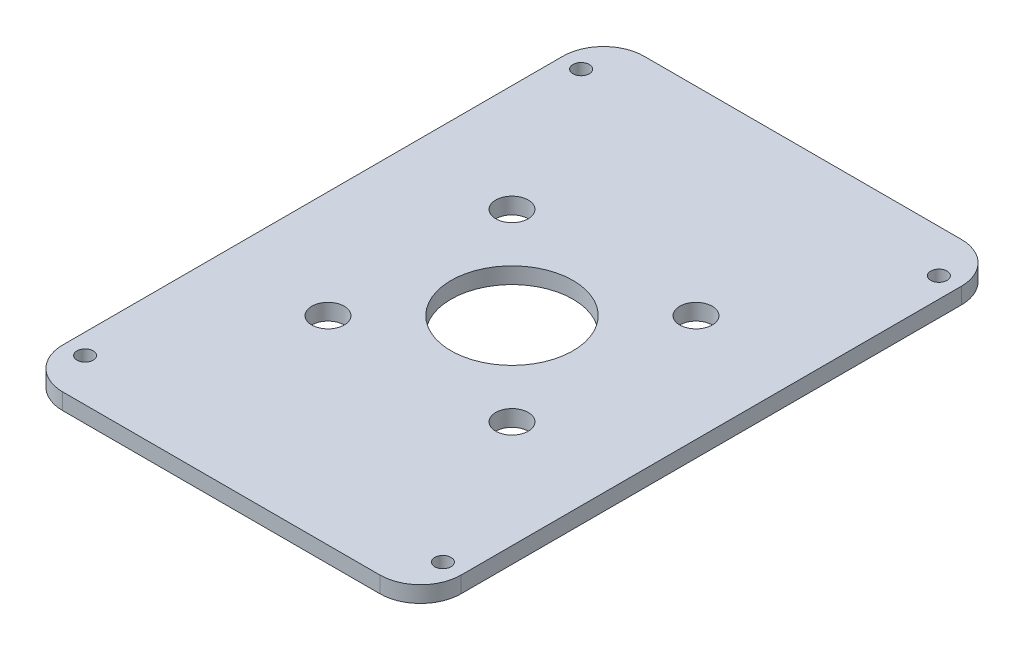
ISO-10303-21;
HEADER;
FILE_DESCRIPTION(('STEP AP214'),'2;1');
FILE_NAME('part.step','',(''),(''),'','','');
FILE_SCHEMA(('AUTOMOTIVE_DESIGN { 1 0 10303 214 1 1 1 1 }'));
ENDSEC;
DATA;
#1=APPLICATION_CONTEXT('core data for automotive mechanical design processes');
#2=APPLICATION_PROTOCOL_DEFINITION('international standard','automotive_design',2000,#1);
#3=PRODUCT_CONTEXT('',#1,'mechanical');
#4=PRODUCT('Part','Part','',(#3));
#5=PRODUCT_RELATED_PRODUCT_CATEGORY('part','',(#4));
#6=PRODUCT_DEFINITION_FORMATION('','',#4);
#7=PRODUCT_DEFINITION_CONTEXT('part definition',#1,'design');
#8=PRODUCT_DEFINITION('design','',#6,#7);
#9=PRODUCT_DEFINITION_SHAPE('','',#8);
#10=(LENGTH_UNIT() NAMED_UNIT(*) SI_UNIT(.MILLI.,.METRE.));
#11=(NAMED_UNIT(*) PLANE_ANGLE_UNIT() SI_UNIT($,.RADIAN.));
#12=(NAMED_UNIT(*) SI_UNIT($,.STERADIAN.) SOLID_ANGLE_UNIT());
#13=UNCERTAINTY_MEASURE_WITH_UNIT(LENGTH_MEASURE(1.E-05),#10,'distance_accuracy_value','');
#14=(GEOMETRIC_REPRESENTATION_CONTEXT(3) GLOBAL_UNCERTAINTY_ASSIGNED_CONTEXT((#13)) GLOBAL_UNIT_ASSIGNED_CONTEXT((#10,
#11,#12)) REPRESENTATION_CONTEXT('',''));
#15=CARTESIAN_POINT('',(0.,0.,0.));
#16=DIRECTION('',(0.,0.,1.));
#17=DIRECTION('',(1.,0.,0.));
#18=AXIS2_PLACEMENT_3D('',#15,#16,#17);
#19=CARTESIAN_POINT('',(-24.5,2.,-35.75));
#20=DIRECTION('',(0.,0.,-1.));
#21=DIRECTION('',(-1.,0.,0.));
#22=AXIS2_PLACEMENT_3D('',#19,#20,#21);
#23=PLANE('',#22);
#24=DIRECTION('',(1.,0.,0.));
#25=VECTOR('',#24,1.);
#26=CARTESIAN_POINT('',(-24.5,2.,-35.75));
#27=LINE('',#26,#25);
#28=CARTESIAN_POINT('',(-19.5,2.,-35.75));
#29=VERTEX_POINT('',#28);
#30=CARTESIAN_POINT('',(19.5,2.,-35.75));
#31=VERTEX_POINT('',#30);
#32=EDGE_CURVE('E168',#29,#31,#27,.T.);
#33=ORIENTED_EDGE('',*,*,#32,.T.);
#34=DIRECTION('',(0.,-1.,0.));
#35=VECTOR('',#34,1.);
#36=CARTESIAN_POINT('',(19.5,2.,-35.75));
#37=LINE('',#36,#35);
#38=CARTESIAN_POINT('',(19.5,0.,-35.75));
#39=VERTEX_POINT('',#38);
#40=EDGE_CURVE('E122',#31,#39,#37,.T.);
#41=ORIENTED_EDGE('',*,*,#40,.T.);
#42=DIRECTION('',(1.,0.,0.));
#43=VECTOR('',#42,1.);
#44=CARTESIAN_POINT('',(-24.5,0.,-35.75));
#45=LINE('',#44,#43);
#46=CARTESIAN_POINT('',(-19.5,0.,-35.75));
#47=VERTEX_POINT('',#46);
#48=EDGE_CURVE('E106',#47,#39,#45,.T.);
#49=ORIENTED_EDGE('',*,*,#48,.F.);
#50=DIRECTION('',(0.,-1.,0.));
#51=VECTOR('',#50,1.);
#52=CARTESIAN_POINT('',(-19.5,2.,-35.75));
#53=LINE('',#52,#51);
#54=EDGE_CURVE('E119',#47,#29,#53,.F.);
#55=ORIENTED_EDGE('',*,*,#54,.T.);
#56=EDGE_LOOP('',(#33,#41,#49,#55));
#57=FACE_BOUND('',#56,.T.);
#58=ADVANCED_FACE('F37',(#57),#23,.T.);
#59=CARTESIAN_POINT('',(-24.5,2.,-35.75));
#60=DIRECTION('',(1.,0.,0.));
#61=DIRECTION('',(0.,0.,-1.));
#62=AXIS2_PLACEMENT_3D('',#59,#60,#61);
#63=PLANE('',#62);
#64=DIRECTION('',(0.,0.,1.));
#65=VECTOR('',#64,1.);
#66=CARTESIAN_POINT('',(-24.5,2.,-35.75));
#67=LINE('',#66,#65);
#68=CARTESIAN_POINT('',(-24.5,2.,-30.75));
#69=VERTEX_POINT('',#68);
#70=CARTESIAN_POINT('',(-24.5,2.,30.75));
#71=VERTEX_POINT('',#70);
#72=EDGE_CURVE('E129',#69,#71,#67,.T.);
#73=ORIENTED_EDGE('',*,*,#72,.F.);
#74=DIRECTION('',(0.,-1.,0.));
#75=VECTOR('',#74,1.);
#76=CARTESIAN_POINT('',(-24.5,0.,-30.75));
#77=LINE('',#76,#75);
#78=CARTESIAN_POINT('',(-24.5,0.,-30.75));
#79=VERTEX_POINT('',#78);
#80=EDGE_CURVE('E154',#69,#79,#77,.T.);
#81=ORIENTED_EDGE('',*,*,#80,.T.);
#82=DIRECTION('',(0.,0.,1.));
#83=VECTOR('',#82,1.);
#84=CARTESIAN_POINT('',(-24.5,0.,-35.75));
#85=LINE('',#84,#83);
#86=CARTESIAN_POINT('',(-24.5,0.,30.75));
#87=VERTEX_POINT('',#86);
#88=EDGE_CURVE('E108',#79,#87,#85,.T.);
#89=ORIENTED_EDGE('',*,*,#88,.T.);
#90=DIRECTION('',(0.,-1.,0.));
#91=VECTOR('',#90,1.);
#92=CARTESIAN_POINT('',(-24.5,2.,30.75));
#93=LINE('',#92,#91);
#94=EDGE_CURVE('E152',#87,#71,#93,.F.);
#95=ORIENTED_EDGE('',*,*,#94,.T.);
#96=EDGE_LOOP('',(#73,#81,#89,#95));
#97=FACE_BOUND('',#96,.T.);
#98=ADVANCED_FACE('F157',(#97),#63,.F.);
#99=CARTESIAN_POINT('',(-24.5,2.,35.75));
#100=DIRECTION('',(0.,0.,-1.));
#101=DIRECTION('',(-1.,0.,0.));
#102=AXIS2_PLACEMENT_3D('',#99,#100,#101);
#103=PLANE('',#102);
#104=DIRECTION('',(1.,0.,0.));
#105=VECTOR('',#104,1.);
#106=CARTESIAN_POINT('',(-24.5,2.,35.75));
#107=LINE('',#106,#105);
#108=CARTESIAN_POINT('',(-19.5,2.,35.75));
#109=VERTEX_POINT('',#108);
#110=CARTESIAN_POINT('',(19.5,2.,35.75));
#111=VERTEX_POINT('',#110);
#112=EDGE_CURVE('E133',#109,#111,#107,.T.);
#113=ORIENTED_EDGE('',*,*,#112,.F.);
#114=DIRECTION('',(0.,-1.,0.));
#115=VECTOR('',#114,1.);
#116=CARTESIAN_POINT('',(-19.5,2.,35.75));
#117=LINE('',#116,#115);
#118=CARTESIAN_POINT('',(-19.5,0.,35.75));
#119=VERTEX_POINT('',#118);
#120=EDGE_CURVE('E11',#109,#119,#117,.T.);
#121=ORIENTED_EDGE('',*,*,#120,.T.);
#122=DIRECTION('',(1.,0.,0.));
#123=VECTOR('',#122,1.);
#124=CARTESIAN_POINT('',(-24.5,0.,35.75));
#125=LINE('',#124,#123);
#126=CARTESIAN_POINT('',(19.5,0.,35.75));
#127=VERTEX_POINT('',#126);
#128=EDGE_CURVE('E166',#119,#127,#125,.T.);
#129=ORIENTED_EDGE('',*,*,#128,.T.);
#130=DIRECTION('',(0.,-1.,0.));
#131=VECTOR('',#130,1.);
#132=CARTESIAN_POINT('',(19.5,2.,35.75));
#133=LINE('',#132,#131);
#134=EDGE_CURVE('E45',#127,#111,#133,.F.);
#135=ORIENTED_EDGE('',*,*,#134,.T.);
#136=EDGE_LOOP('',(#113,#121,#129,#135));
#137=FACE_BOUND('',#136,.T.);
#138=ADVANCED_FACE('F165',(#137),#103,.F.);
#139=CARTESIAN_POINT('',(24.5,2.,-35.75));
#140=DIRECTION('',(1.,0.,0.));
#141=DIRECTION('',(0.,0.,-1.));
#142=AXIS2_PLACEMENT_3D('',#139,#140,#141);
#143=PLANE('',#142);
#144=DIRECTION('',(0.,0.,1.));
#145=VECTOR('',#144,1.);
#146=CARTESIAN_POINT('',(24.5,0.,-35.75));
#147=LINE('',#146,#145);
#148=CARTESIAN_POINT('',(24.5,0.,-30.75));
#149=VERTEX_POINT('',#148);
#150=CARTESIAN_POINT('',(24.5,0.,30.75));
#151=VERTEX_POINT('',#150);
#152=EDGE_CURVE('E123',#149,#151,#147,.T.);
#153=ORIENTED_EDGE('',*,*,#152,.F.);
#154=DIRECTION('',(0.,-1.,0.));
#155=VECTOR('',#154,1.);
#156=CARTESIAN_POINT('',(24.5,2.,-30.75));
#157=LINE('',#156,#155);
#158=CARTESIAN_POINT('',(24.5,2.,-30.75));
#159=VERTEX_POINT('',#158);
#160=EDGE_CURVE('E144',#149,#159,#157,.F.);
#161=ORIENTED_EDGE('',*,*,#160,.T.);
#162=DIRECTION('',(0.,0.,1.));
#163=VECTOR('',#162,1.);
#164=CARTESIAN_POINT('',(24.5,2.,-35.75));
#165=LINE('',#164,#163);
#166=CARTESIAN_POINT('',(24.5,2.,30.75));
#167=VERTEX_POINT('',#166);
#168=EDGE_CURVE('E172',#159,#167,#165,.T.);
#169=ORIENTED_EDGE('',*,*,#168,.T.);
#170=DIRECTION('',(0.,-1.,0.));
#171=VECTOR('',#170,1.);
#172=CARTESIAN_POINT('',(24.5,0.,30.75));
#173=LINE('',#172,#171);
#174=EDGE_CURVE('E141',#167,#151,#173,.T.);
#175=ORIENTED_EDGE('',*,*,#174,.T.);
#176=EDGE_LOOP('',(#153,#161,#169,#175));
#177=FACE_BOUND('',#176,.T.);
#178=ADVANCED_FACE('F242',(#177),#143,.T.);
#179=CARTESIAN_POINT('',(0.,2.,0.));
#180=DIRECTION('',(0.,-1.,0.));
#181=DIRECTION('',(0.,0.,-1.));
#182=AXIS2_PLACEMENT_3D('',#179,#180,#181);
#183=PLANE('',#182);
#184=CARTESIAN_POINT('',(0.,2.,0.));
#185=DIRECTION('',(0.,-1.,0.));
#186=DIRECTION('',(0.,0.,-1.));
#187=AXIS2_PLACEMENT_3D('',#184,#185,#186);
#188=CIRCLE('',#187,7.5);
#189=CARTESIAN_POINT('',(0.,2.,-7.49999999999999));
#190=VERTEX_POINT('',#189);
#191=EDGE_CURVE('E124',#190,#190,#188,.F.);
#192=ORIENTED_EDGE('',*,*,#191,.F.);
#193=EDGE_LOOP('',(#192));
#194=FACE_BOUND('',#193,.T.);
#195=CARTESIAN_POINT('',(-22.,2.,30.5));
#196=DIRECTION('',(0.,-1.,0.));
#197=DIRECTION('',(0.,0.,-1.));
#198=AXIS2_PLACEMENT_3D('',#195,#196,#197);
#199=CIRCLE('',#198,1.);
#200=CARTESIAN_POINT('',(-22.,2.,29.5));
#201=VERTEX_POINT('',#200);
#202=EDGE_CURVE('E178',#201,#201,#199,.F.);
#203=ORIENTED_EDGE('',*,*,#202,.F.);
#204=EDGE_LOOP('',(#203));
#205=FACE_BOUND('',#204,.T.);
#206=CARTESIAN_POINT('',(22.,2.,30.5));
#207=DIRECTION('',(0.,-1.,0.));
#208=DIRECTION('',(0.,0.,-1.));
#209=AXIS2_PLACEMENT_3D('',#206,#207,#208);
#210=CIRCLE('',#209,1.);
#211=CARTESIAN_POINT('',(22.,2.,29.5));
#212=VERTEX_POINT('',#211);
#213=EDGE_CURVE('E181',#212,#212,#210,.F.);
#214=ORIENTED_EDGE('',*,*,#213,.F.);
#215=EDGE_LOOP('',(#214));
#216=FACE_BOUND('',#215,.T.);
#217=CARTESIAN_POINT('',(22.,2.,-30.5));
#218=DIRECTION('',(0.,-1.,0.));
#219=DIRECTION('',(0.,0.,-1.));
#220=AXIS2_PLACEMENT_3D('',#217,#218,#219);
#221=CIRCLE('',#220,1.);
#222=CARTESIAN_POINT('',(22.,2.,-31.5));
#223=VERTEX_POINT('',#222);
#224=EDGE_CURVE('E184',#223,#223,#221,.F.);
#225=ORIENTED_EDGE('',*,*,#224,.F.);
#226=EDGE_LOOP('',(#225));
#227=FACE_BOUND('',#226,.T.);
#228=CARTESIAN_POINT('',(11.3137084989848,2.,-11.3137084989847));
#229=DIRECTION('',(0.,-1.,0.));
#230=DIRECTION('',(0.,0.,-1.));
#231=AXIS2_PLACEMENT_3D('',#228,#229,#230);
#232=CIRCLE('',#231,2.);
#233=CARTESIAN_POINT('',(11.3137084989848,2.,-13.3137084989847));
#234=VERTEX_POINT('',#233);
#235=EDGE_CURVE('E187',#234,#234,#232,.F.);
#236=ORIENTED_EDGE('',*,*,#235,.F.);
#237=EDGE_LOOP('',(#236));
#238=FACE_BOUND('',#237,.T.);
#239=CARTESIAN_POINT('',(11.3137084989853,2.,11.3137084989848));
#240=DIRECTION('',(0.,-1.,0.));
#241=DIRECTION('',(0.,0.,-1.));
#242=AXIS2_PLACEMENT_3D('',#239,#240,#241);
#243=CIRCLE('',#242,2.);
#244=CARTESIAN_POINT('',(11.3137084989853,2.,9.31370849898481));
#245=VERTEX_POINT('',#244);
#246=EDGE_CURVE('E190',#245,#245,#243,.F.);
#247=ORIENTED_EDGE('',*,*,#246,.F.);
#248=EDGE_LOOP('',(#247));
#249=FACE_BOUND('',#248,.T.);
#250=CARTESIAN_POINT('',(-11.3137084989842,2.,11.3137084989853));
#251=DIRECTION('',(0.,-1.,0.));
#252=DIRECTION('',(0.,0.,-1.));
#253=AXIS2_PLACEMENT_3D('',#250,#251,#252);
#254=CIRCLE('',#253,2.);
#255=CARTESIAN_POINT('',(-11.3137084989842,2.,9.3137084989853));
#256=VERTEX_POINT('',#255);
#257=EDGE_CURVE('E193',#256,#256,#254,.F.);
#258=ORIENTED_EDGE('',*,*,#257,.F.);
#259=EDGE_LOOP('',(#258));
#260=FACE_BOUND('',#259,.T.);
#261=CARTESIAN_POINT('',(-11.3137084989847,2.,-11.3137084989842));
#262=DIRECTION('',(0.,-1.,0.));
#263=DIRECTION('',(0.,0.,-1.));
#264=AXIS2_PLACEMENT_3D('',#261,#262,#263);
#265=CIRCLE('',#264,2.);
#266=CARTESIAN_POINT('',(-11.3137084989847,2.,-13.3137084989842));
#267=VERTEX_POINT('',#266);
#268=EDGE_CURVE('E196',#267,#267,#265,.F.);
#269=ORIENTED_EDGE('',*,*,#268,.F.);
#270=EDGE_LOOP('',(#269));
#271=FACE_BOUND('',#270,.T.);
#272=CARTESIAN_POINT('',(-22.,2.,-30.5));
#273=DIRECTION('',(0.,-1.,0.));
#274=DIRECTION('',(0.,0.,-1.));
#275=AXIS2_PLACEMENT_3D('',#272,#273,#274);
#276=CIRCLE('',#275,1.);
#277=CARTESIAN_POINT('',(-22.,2.,-31.5));
#278=VERTEX_POINT('',#277);
#279=EDGE_CURVE('E199',#278,#278,#276,.F.);
#280=ORIENTED_EDGE('',*,*,#279,.F.);
#281=EDGE_LOOP('',(#280));
#282=FACE_BOUND('',#281,.T.);
#283=ORIENTED_EDGE('',*,*,#168,.F.);
#284=CARTESIAN_POINT('',(19.5,2.,-30.75));
#285=DIRECTION('',(0.,-1.,0.));
#286=DIRECTION('',(0.,0.,-1.));
#287=AXIS2_PLACEMENT_3D('',#284,#285,#286);
#288=CIRCLE('',#287,5.);
#289=EDGE_CURVE('E150',#159,#31,#288,.F.);
#290=ORIENTED_EDGE('',*,*,#289,.T.);
#291=ORIENTED_EDGE('',*,*,#32,.F.);
#292=CARTESIAN_POINT('',(-19.5,2.,-30.75));
#293=DIRECTION('',(0.,-1.,0.));
#294=DIRECTION('',(0.,0.,-1.));
#295=AXIS2_PLACEMENT_3D('',#292,#293,#294);
#296=CIRCLE('',#295,5.);
#297=EDGE_CURVE('E128',#29,#69,#296,.F.);
#298=ORIENTED_EDGE('',*,*,#297,.T.);
#299=ORIENTED_EDGE('',*,*,#72,.T.);
#300=CARTESIAN_POINT('',(-19.5,2.,30.75));
#301=DIRECTION('',(0.,-1.,0.));
#302=DIRECTION('',(0.,0.,-1.));
#303=AXIS2_PLACEMENT_3D('',#300,#301,#302);
#304=CIRCLE('',#303,5.);
#305=EDGE_CURVE('E58',#71,#109,#304,.F.);
#306=ORIENTED_EDGE('',*,*,#305,.T.);
#307=ORIENTED_EDGE('',*,*,#112,.T.);
#308=CARTESIAN_POINT('',(19.5,2.,30.75));
#309=DIRECTION('',(0.,-1.,0.));
#310=DIRECTION('',(0.,0.,-1.));
#311=AXIS2_PLACEMENT_3D('',#308,#309,#310);
#312=CIRCLE('',#311,5.);
#313=EDGE_CURVE('E146',#111,#167,#312,.F.);
#314=ORIENTED_EDGE('',*,*,#313,.T.);
#315=EDGE_LOOP('',(#283,#290,#291,#298,#299,#306,#307,#314));
#316=FACE_BOUND('',#315,.T.);
#317=ADVANCED_FACE('F160',(#194,#205,#216,#227,#238,#249,#260,#271,#282,#316),#183,.F.);
#318=CARTESIAN_POINT('',(0.,0.,0.));
#319=DIRECTION('',(0.,-1.,0.));
#320=DIRECTION('',(0.,0.,-1.));
#321=AXIS2_PLACEMENT_3D('',#318,#319,#320);
#322=PLANE('',#321);
#323=CARTESIAN_POINT('',(0.,0.,0.));
#324=DIRECTION('',(0.,1.,0.));
#325=DIRECTION('',(0.,0.,1.));
#326=AXIS2_PLACEMENT_3D('',#323,#324,#325);
#327=CIRCLE('',#326,7.5);
#328=CARTESIAN_POINT('',(0.,0.,7.50000000000001));
#329=VERTEX_POINT('',#328);
#330=EDGE_CURVE('E205',#329,#329,#327,.T.);
#331=ORIENTED_EDGE('',*,*,#330,.T.);
#332=EDGE_LOOP('',(#331));
#333=FACE_BOUND('',#332,.T.);
#334=CARTESIAN_POINT('',(-22.,0.,30.5));
#335=DIRECTION('',(0.,1.,0.));
#336=DIRECTION('',(0.,0.,1.));
#337=AXIS2_PLACEMENT_3D('',#334,#335,#336);
#338=CIRCLE('',#337,1.);
#339=CARTESIAN_POINT('',(-22.,0.,31.5));
#340=VERTEX_POINT('',#339);
#341=EDGE_CURVE('E213',#340,#340,#338,.T.);
#342=ORIENTED_EDGE('',*,*,#341,.T.);
#343=EDGE_LOOP('',(#342));
#344=FACE_BOUND('',#343,.T.);
#345=CARTESIAN_POINT('',(22.,0.,30.5));
#346=DIRECTION('',(0.,1.,0.));
#347=DIRECTION('',(0.,0.,1.));
#348=AXIS2_PLACEMENT_3D('',#345,#346,#347);
#349=CIRCLE('',#348,1.);
#350=CARTESIAN_POINT('',(22.,0.,31.5));
#351=VERTEX_POINT('',#350);
#352=EDGE_CURVE('E209',#351,#351,#349,.T.);
#353=ORIENTED_EDGE('',*,*,#352,.T.);
#354=EDGE_LOOP('',(#353));
#355=FACE_BOUND('',#354,.T.);
#356=CARTESIAN_POINT('',(22.,0.,-30.5));
#357=DIRECTION('',(0.,1.,0.));
#358=DIRECTION('',(0.,0.,1.));
#359=AXIS2_PLACEMENT_3D('',#356,#357,#358);
#360=CIRCLE('',#359,1.);
#361=CARTESIAN_POINT('',(22.,0.,-29.5));
#362=VERTEX_POINT('',#361);
#363=EDGE_CURVE('E206',#362,#362,#360,.T.);
#364=ORIENTED_EDGE('',*,*,#363,.T.);
#365=EDGE_LOOP('',(#364));
#366=FACE_BOUND('',#365,.T.);
#367=CARTESIAN_POINT('',(11.3137084989848,0.,-11.3137084989847));
#368=DIRECTION('',(0.,1.,0.));
#369=DIRECTION('',(0.,0.,1.));
#370=AXIS2_PLACEMENT_3D('',#367,#368,#369);
#371=CIRCLE('',#370,2.);
#372=CARTESIAN_POINT('',(11.3137084989848,0.,-9.3137084989847));
#373=VERTEX_POINT('',#372);
#374=EDGE_CURVE('E210',#373,#373,#371,.T.);
#375=ORIENTED_EDGE('',*,*,#374,.T.);
#376=EDGE_LOOP('',(#375));
#377=FACE_BOUND('',#376,.T.);
#378=CARTESIAN_POINT('',(11.3137084989853,0.,11.3137084989848));
#379=DIRECTION('',(0.,1.,0.));
#380=DIRECTION('',(0.,0.,1.));
#381=AXIS2_PLACEMENT_3D('',#378,#379,#380);
#382=CIRCLE('',#381,2.);
#383=CARTESIAN_POINT('',(11.3137084989853,0.,13.3137084989848));
#384=VERTEX_POINT('',#383);
#385=EDGE_CURVE('E224',#384,#384,#382,.T.);
#386=ORIENTED_EDGE('',*,*,#385,.T.);
#387=EDGE_LOOP('',(#386));
#388=FACE_BOUND('',#387,.T.);
#389=CARTESIAN_POINT('',(-11.3137084989842,0.,11.3137084989853));
#390=DIRECTION('',(0.,1.,0.));
#391=DIRECTION('',(0.,0.,1.));
#392=AXIS2_PLACEMENT_3D('',#389,#390,#391);
#393=CIRCLE('',#392,2.);
#394=CARTESIAN_POINT('',(-11.3137084989842,0.,13.3137084989853));
#395=VERTEX_POINT('',#394);
#396=EDGE_CURVE('E221',#395,#395,#393,.T.);
#397=ORIENTED_EDGE('',*,*,#396,.T.);
#398=EDGE_LOOP('',(#397));
#399=FACE_BOUND('',#398,.T.);
#400=CARTESIAN_POINT('',(-11.3137084989847,0.,-11.3137084989842));
#401=DIRECTION('',(0.,1.,0.));
#402=DIRECTION('',(0.,0.,1.));
#403=AXIS2_PLACEMENT_3D('',#400,#401,#402);
#404=CIRCLE('',#403,2.);
#405=CARTESIAN_POINT('',(-11.3137084989847,0.,-9.31370849898421));
#406=VERTEX_POINT('',#405);
#407=EDGE_CURVE('E218',#406,#406,#404,.T.);
#408=ORIENTED_EDGE('',*,*,#407,.T.);
#409=EDGE_LOOP('',(#408));
#410=FACE_BOUND('',#409,.T.);
#411=CARTESIAN_POINT('',(-22.,0.,-30.5));
#412=DIRECTION('',(0.,1.,0.));
#413=DIRECTION('',(0.,0.,1.));
#414=AXIS2_PLACEMENT_3D('',#411,#412,#413);
#415=CIRCLE('',#414,1.);
#416=CARTESIAN_POINT('',(-22.,0.,-29.5));
#417=VERTEX_POINT('',#416);
#418=EDGE_CURVE('E202',#417,#417,#415,.T.);
#419=ORIENTED_EDGE('',*,*,#418,.T.);
#420=EDGE_LOOP('',(#419));
#421=FACE_BOUND('',#420,.T.);
#422=ORIENTED_EDGE('',*,*,#48,.T.);
#423=CARTESIAN_POINT('',(19.5,0.,-30.75));
#424=DIRECTION('',(0.,-1.,0.));
#425=DIRECTION('',(0.,0.,-1.));
#426=AXIS2_PLACEMENT_3D('',#423,#424,#425);
#427=CIRCLE('',#426,5.);
#428=EDGE_CURVE('E113',#39,#149,#427,.T.);
#429=ORIENTED_EDGE('',*,*,#428,.T.);
#430=ORIENTED_EDGE('',*,*,#152,.T.);
#431=CARTESIAN_POINT('',(19.5,0.,30.75));
#432=DIRECTION('',(0.,-1.,0.));
#433=DIRECTION('',(0.,0.,-1.));
#434=AXIS2_PLACEMENT_3D('',#431,#432,#433);
#435=CIRCLE('',#434,5.);
#436=EDGE_CURVE('E131',#151,#127,#435,.T.);
#437=ORIENTED_EDGE('',*,*,#436,.T.);
#438=ORIENTED_EDGE('',*,*,#128,.F.);
#439=CARTESIAN_POINT('',(-19.5,0.,30.75));
#440=DIRECTION('',(0.,-1.,0.));
#441=DIRECTION('',(0.,0.,-1.));
#442=AXIS2_PLACEMENT_3D('',#439,#440,#441);
#443=CIRCLE('',#442,5.);
#444=EDGE_CURVE('E114',#119,#87,#443,.T.);
#445=ORIENTED_EDGE('',*,*,#444,.T.);
#446=ORIENTED_EDGE('',*,*,#88,.F.);
#447=CARTESIAN_POINT('',(-19.5,0.,-30.75));
#448=DIRECTION('',(0.,-1.,0.));
#449=DIRECTION('',(0.,0.,-1.));
#450=AXIS2_PLACEMENT_3D('',#447,#448,#449);
#451=CIRCLE('',#450,5.);
#452=EDGE_CURVE('E103',#79,#47,#451,.T.);
#453=ORIENTED_EDGE('',*,*,#452,.T.);
#454=EDGE_LOOP('',(#422,#429,#430,#437,#438,#445,#446,#453));
#455=FACE_BOUND('',#454,.T.);
#456=ADVANCED_FACE('F105',(#333,#344,#355,#366,#377,#388,#399,#410,#421,#455),#322,.T.);
#457=CARTESIAN_POINT('',(-22.,10.,-30.5));
#458=DIRECTION('',(0.,-1.,0.));
#459=DIRECTION('',(0.,0.,-1.));
#460=AXIS2_PLACEMENT_3D('',#457,#458,#459);
#461=CYLINDRICAL_SURFACE('',#460,1.);
#462=ORIENTED_EDGE('',*,*,#418,.F.);
#463=EDGE_LOOP('',(#462));
#464=FACE_BOUND('',#463,.T.);
#465=ORIENTED_EDGE('',*,*,#279,.T.);
#466=EDGE_LOOP('',(#465));
#467=FACE_BOUND('',#466,.T.);
#468=ADVANCED_FACE('F253',(#464,#467),#461,.F.);
#469=CARTESIAN_POINT('',(-11.3137084989847,10.,-11.3137084989842));
#470=DIRECTION('',(0.,-1.,0.));
#471=DIRECTION('',(0.,0.,-1.));
#472=AXIS2_PLACEMENT_3D('',#469,#470,#471);
#473=CYLINDRICAL_SURFACE('',#472,2.);
#474=ORIENTED_EDGE('',*,*,#407,.F.);
#475=EDGE_LOOP('',(#474));
#476=FACE_BOUND('',#475,.T.);
#477=ORIENTED_EDGE('',*,*,#268,.T.);
#478=EDGE_LOOP('',(#477));
#479=FACE_BOUND('',#478,.T.);
#480=ADVANCED_FACE('F255',(#476,#479),#473,.F.);
#481=CARTESIAN_POINT('',(-11.3137084989842,10.,11.3137084989853));
#482=DIRECTION('',(0.,-1.,0.));
#483=DIRECTION('',(0.,0.,-1.));
#484=AXIS2_PLACEMENT_3D('',#481,#482,#483);
#485=CYLINDRICAL_SURFACE('',#484,2.);
#486=ORIENTED_EDGE('',*,*,#396,.F.);
#487=EDGE_LOOP('',(#486));
#488=FACE_BOUND('',#487,.T.);
#489=ORIENTED_EDGE('',*,*,#257,.T.);
#490=EDGE_LOOP('',(#489));
#491=FACE_BOUND('',#490,.T.);
#492=ADVANCED_FACE('F262',(#488,#491),#485,.F.);
#493=CARTESIAN_POINT('',(11.3137084989853,10.,11.3137084989848));
#494=DIRECTION('',(0.,-1.,0.));
#495=DIRECTION('',(0.,0.,-1.));
#496=AXIS2_PLACEMENT_3D('',#493,#494,#495);
#497=CYLINDRICAL_SURFACE('',#496,2.);
#498=ORIENTED_EDGE('',*,*,#385,.F.);
#499=EDGE_LOOP('',(#498));
#500=FACE_BOUND('',#499,.T.);
#501=ORIENTED_EDGE('',*,*,#246,.T.);
#502=EDGE_LOOP('',(#501));
#503=FACE_BOUND('',#502,.T.);
#504=ADVANCED_FACE('F236',(#500,#503),#497,.F.);
#505=CARTESIAN_POINT('',(11.3137084989848,10.,-11.3137084989847));
#506=DIRECTION('',(0.,-1.,0.));
#507=DIRECTION('',(0.,0.,-1.));
#508=AXIS2_PLACEMENT_3D('',#505,#506,#507);
#509=CYLINDRICAL_SURFACE('',#508,2.);
#510=ORIENTED_EDGE('',*,*,#374,.F.);
#511=EDGE_LOOP('',(#510));
#512=FACE_BOUND('',#511,.T.);
#513=ORIENTED_EDGE('',*,*,#235,.T.);
#514=EDGE_LOOP('',(#513));
#515=FACE_BOUND('',#514,.T.);
#516=ADVANCED_FACE('F232',(#512,#515),#509,.F.);
#517=CARTESIAN_POINT('',(22.,10.,-30.5));
#518=DIRECTION('',(0.,-1.,0.));
#519=DIRECTION('',(0.,0.,-1.));
#520=AXIS2_PLACEMENT_3D('',#517,#518,#519);
#521=CYLINDRICAL_SURFACE('',#520,1.);
#522=ORIENTED_EDGE('',*,*,#363,.F.);
#523=EDGE_LOOP('',(#522));
#524=FACE_BOUND('',#523,.T.);
#525=ORIENTED_EDGE('',*,*,#224,.T.);
#526=EDGE_LOOP('',(#525));
#527=FACE_BOUND('',#526,.T.);
#528=ADVANCED_FACE('F235',(#524,#527),#521,.F.);
#529=CARTESIAN_POINT('',(22.,10.,30.5));
#530=DIRECTION('',(0.,-1.,0.));
#531=DIRECTION('',(0.,0.,-1.));
#532=AXIS2_PLACEMENT_3D('',#529,#530,#531);
#533=CYLINDRICAL_SURFACE('',#532,1.);
#534=ORIENTED_EDGE('',*,*,#352,.F.);
#535=EDGE_LOOP('',(#534));
#536=FACE_BOUND('',#535,.T.);
#537=ORIENTED_EDGE('',*,*,#213,.T.);
#538=EDGE_LOOP('',(#537));
#539=FACE_BOUND('',#538,.T.);
#540=ADVANCED_FACE('F331',(#536,#539),#533,.F.);
#541=CARTESIAN_POINT('',(-22.,10.,30.5));
#542=DIRECTION('',(0.,-1.,0.));
#543=DIRECTION('',(0.,0.,-1.));
#544=AXIS2_PLACEMENT_3D('',#541,#542,#543);
#545=CYLINDRICAL_SURFACE('',#544,1.);
#546=ORIENTED_EDGE('',*,*,#341,.F.);
#547=EDGE_LOOP('',(#546));
#548=FACE_BOUND('',#547,.T.);
#549=ORIENTED_EDGE('',*,*,#202,.T.);
#550=EDGE_LOOP('',(#549));
#551=FACE_BOUND('',#550,.T.);
#552=ADVANCED_FACE('F320',(#548,#551),#545,.F.);
#553=CARTESIAN_POINT('',(0.,10.,0.));
#554=DIRECTION('',(0.,-1.,0.));
#555=DIRECTION('',(0.,0.,-1.));
#556=AXIS2_PLACEMENT_3D('',#553,#554,#555);
#557=CYLINDRICAL_SURFACE('',#556,7.5);
#558=ORIENTED_EDGE('',*,*,#330,.F.);
#559=EDGE_LOOP('',(#558));
#560=FACE_BOUND('',#559,.T.);
#561=ORIENTED_EDGE('',*,*,#191,.T.);
#562=EDGE_LOOP('',(#561));
#563=FACE_BOUND('',#562,.T.);
#564=ADVANCED_FACE('F281',(#560,#563),#557,.F.);
#565=CARTESIAN_POINT('',(19.5,2.,-30.75));
#566=DIRECTION('',(0.,-1.,0.));
#567=DIRECTION('',(0.,0.,-1.));
#568=AXIS2_PLACEMENT_3D('',#565,#566,#567);
#569=CYLINDRICAL_SURFACE('',#568,5.);
#570=ORIENTED_EDGE('',*,*,#289,.F.);
#571=ORIENTED_EDGE('',*,*,#160,.F.);
#572=ORIENTED_EDGE('',*,*,#428,.F.);
#573=ORIENTED_EDGE('',*,*,#40,.F.);
#574=EDGE_LOOP('',(#570,#571,#572,#573));
#575=FACE_BOUND('',#574,.T.);
#576=ADVANCED_FACE('F278',(#575),#569,.T.);
#577=CARTESIAN_POINT('',(-19.5,2.,-30.75));
#578=DIRECTION('',(0.,1.,0.));
#579=DIRECTION('',(0.,0.,1.));
#580=AXIS2_PLACEMENT_3D('',#577,#578,#579);
#581=CYLINDRICAL_SURFACE('',#580,5.);
#582=ORIENTED_EDGE('',*,*,#297,.F.);
#583=ORIENTED_EDGE('',*,*,#54,.F.);
#584=ORIENTED_EDGE('',*,*,#452,.F.);
#585=ORIENTED_EDGE('',*,*,#80,.F.);
#586=EDGE_LOOP('',(#582,#583,#584,#585));
#587=FACE_BOUND('',#586,.T.);
#588=ADVANCED_FACE('F127',(#587),#581,.T.);
#589=CARTESIAN_POINT('',(-19.5,2.,30.75));
#590=DIRECTION('',(0.,-1.,0.));
#591=DIRECTION('',(0.,0.,-1.));
#592=AXIS2_PLACEMENT_3D('',#589,#590,#591);
#593=CYLINDRICAL_SURFACE('',#592,5.);
#594=ORIENTED_EDGE('',*,*,#305,.F.);
#595=ORIENTED_EDGE('',*,*,#94,.F.);
#596=ORIENTED_EDGE('',*,*,#444,.F.);
#597=ORIENTED_EDGE('',*,*,#120,.F.);
#598=EDGE_LOOP('',(#594,#595,#596,#597));
#599=FACE_BOUND('',#598,.T.);
#600=ADVANCED_FACE('F163',(#599),#593,.T.);
#601=CARTESIAN_POINT('',(19.5,2.,30.75));
#602=DIRECTION('',(0.,1.,0.));
#603=DIRECTION('',(0.,0.,1.));
#604=AXIS2_PLACEMENT_3D('',#601,#602,#603);
#605=CYLINDRICAL_SURFACE('',#604,5.);
#606=ORIENTED_EDGE('',*,*,#313,.F.);
#607=ORIENTED_EDGE('',*,*,#134,.F.);
#608=ORIENTED_EDGE('',*,*,#436,.F.);
#609=ORIENTED_EDGE('',*,*,#174,.F.);
#610=EDGE_LOOP('',(#606,#607,#608,#609));
#611=FACE_BOUND('',#610,.T.);
#612=ADVANCED_FACE('F39',(#611),#605,.T.);
#613=CLOSED_SHELL('',(#58,#98,#138,#178,#317,#456,#468,#480,#492,#504,#516,#528,#540,#552,#564,
#576,#588,#600,#612));
#614=MANIFOLD_SOLID_BREP('B2',#613);
#615=ADVANCED_BREP_SHAPE_REPRESENTATION('',(#18,#614),#14);
#616=SHAPE_DEFINITION_REPRESENTATION(#9,#615);
ENDSEC;
END-ISO-10303-21;
